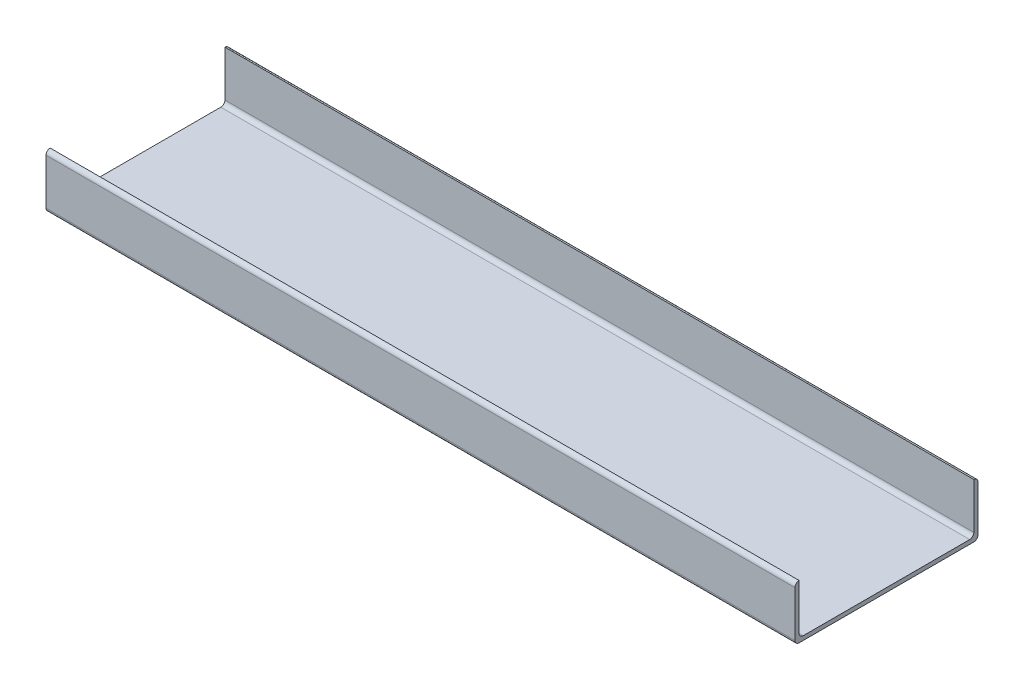
ISO-10303-21;
HEADER;
FILE_DESCRIPTION(('STEP AP214'),'2;1');
FILE_NAME('part.step','',(''),(''),'','','');
FILE_SCHEMA(('AUTOMOTIVE_DESIGN { 1 0 10303 214 1 1 1 1 }'));
ENDSEC;
DATA;
#1=APPLICATION_CONTEXT('core data for automotive mechanical design processes');
#2=APPLICATION_PROTOCOL_DEFINITION('international standard','automotive_design',2000,#1);
#3=PRODUCT_CONTEXT('',#1,'mechanical');
#4=PRODUCT('Part','Part','',(#3));
#5=PRODUCT_RELATED_PRODUCT_CATEGORY('part','',(#4));
#6=PRODUCT_DEFINITION_FORMATION('','',#4);
#7=PRODUCT_DEFINITION_CONTEXT('part definition',#1,'design');
#8=PRODUCT_DEFINITION('design','',#6,#7);
#9=PRODUCT_DEFINITION_SHAPE('','',#8);
#10=(LENGTH_UNIT() NAMED_UNIT(*) SI_UNIT(.MILLI.,.METRE.));
#11=(NAMED_UNIT(*) PLANE_ANGLE_UNIT() SI_UNIT($,.RADIAN.));
#12=(NAMED_UNIT(*) SI_UNIT($,.STERADIAN.) SOLID_ANGLE_UNIT());
#13=UNCERTAINTY_MEASURE_WITH_UNIT(LENGTH_MEASURE(1.E-05),#10,'distance_accuracy_value','');
#14=(GEOMETRIC_REPRESENTATION_CONTEXT(3) GLOBAL_UNCERTAINTY_ASSIGNED_CONTEXT((#13)) GLOBAL_UNIT_ASSIGNED_CONTEXT((#10,
#11,#12)) REPRESENTATION_CONTEXT('',''));
#15=CARTESIAN_POINT('',(0.,0.,0.));
#16=DIRECTION('',(0.,0.,1.));
#17=DIRECTION('',(1.,0.,0.));
#18=AXIS2_PLACEMENT_3D('',#15,#16,#17);
#19=CARTESIAN_POINT('',(-90.,1.,-21.));
#20=DIRECTION('',(-1.,0.,0.));
#21=DIRECTION('',(0.,0.,1.));
#22=AXIS2_PLACEMENT_3D('',#19,#20,#21);
#23=CYLINDRICAL_SURFACE('',#22,1.);
#24=DIRECTION('',(-1.,0.,0.));
#25=VECTOR('',#24,1.);
#26=CARTESIAN_POINT('',(-90.,1.,-22.));
#27=LINE('',#26,#25);
#28=CARTESIAN_POINT('',(90.,1.,-22.));
#29=VERTEX_POINT('',#28);
#30=CARTESIAN_POINT('',(-90.,1.,-22.));
#31=VERTEX_POINT('',#30);
#32=EDGE_CURVE('E191',#29,#31,#27,.T.);
#33=ORIENTED_EDGE('',*,*,#32,.F.);
#34=CARTESIAN_POINT('',(90.,1.,-21.));
#35=DIRECTION('',(-1.,0.,0.));
#36=DIRECTION('',(0.,0.,1.));
#37=AXIS2_PLACEMENT_3D('',#34,#35,#36);
#38=CIRCLE('',#37,1.);
#39=CARTESIAN_POINT('',(90.,0.,-21.));
#40=VERTEX_POINT('',#39);
#41=EDGE_CURVE('E39',#40,#29,#38,.F.);
#42=ORIENTED_EDGE('',*,*,#41,.F.);
#43=DIRECTION('',(-1.,0.,0.));
#44=VECTOR('',#43,1.);
#45=CARTESIAN_POINT('',(0.,0.,-21.));
#46=LINE('',#45,#44);
#47=CARTESIAN_POINT('',(-90.,0.,-21.));
#48=VERTEX_POINT('',#47);
#49=EDGE_CURVE('E194',#48,#40,#46,.F.);
#50=ORIENTED_EDGE('',*,*,#49,.F.);
#51=CARTESIAN_POINT('',(-90.,1.,-21.));
#52=DIRECTION('',(1.,0.,0.));
#53=DIRECTION('',(0.,0.,-1.));
#54=AXIS2_PLACEMENT_3D('',#51,#52,#53);
#55=CIRCLE('',#54,1.);
#56=EDGE_CURVE('E11',#31,#48,#55,.F.);
#57=ORIENTED_EDGE('',*,*,#56,.F.);
#58=EDGE_LOOP('',(#33,#42,#50,#57));
#59=FACE_BOUND('',#58,.T.);
#60=ADVANCED_FACE('F32',(#59),#23,.T.);
#61=CARTESIAN_POINT('',(-90.,1.,21.));
#62=DIRECTION('',(1.,0.,0.));
#63=DIRECTION('',(0.,0.,-1.));
#64=AXIS2_PLACEMENT_3D('',#61,#62,#63);
#65=CYLINDRICAL_SURFACE('',#64,1.);
#66=DIRECTION('',(1.,0.,0.));
#67=VECTOR('',#66,1.);
#68=CARTESIAN_POINT('',(-90.,1.,22.));
#69=LINE('',#68,#67);
#70=CARTESIAN_POINT('',(-90.,1.,22.));
#71=VERTEX_POINT('',#70);
#72=CARTESIAN_POINT('',(90.,1.,22.));
#73=VERTEX_POINT('',#72);
#74=EDGE_CURVE('E181',#71,#73,#69,.T.);
#75=ORIENTED_EDGE('',*,*,#74,.F.);
#76=CARTESIAN_POINT('',(-90.,1.,21.));
#77=DIRECTION('',(1.,0.,0.));
#78=DIRECTION('',(0.,0.,-1.));
#79=AXIS2_PLACEMENT_3D('',#76,#77,#78);
#80=CIRCLE('',#79,1.);
#81=CARTESIAN_POINT('',(-90.,0.,21.));
#82=VERTEX_POINT('',#81);
#83=EDGE_CURVE('E187',#82,#71,#80,.F.);
#84=ORIENTED_EDGE('',*,*,#83,.F.);
#85=DIRECTION('',(1.,0.,0.));
#86=VECTOR('',#85,1.);
#87=CARTESIAN_POINT('',(0.,0.,21.));
#88=LINE('',#87,#86);
#89=CARTESIAN_POINT('',(90.,0.,21.));
#90=VERTEX_POINT('',#89);
#91=EDGE_CURVE('E184',#90,#82,#88,.F.);
#92=ORIENTED_EDGE('',*,*,#91,.F.);
#93=CARTESIAN_POINT('',(90.,1.,21.));
#94=DIRECTION('',(-1.,0.,0.));
#95=DIRECTION('',(0.,0.,1.));
#96=AXIS2_PLACEMENT_3D('',#93,#94,#95);
#97=CIRCLE('',#96,1.);
#98=EDGE_CURVE('E189',#73,#90,#97,.F.);
#99=ORIENTED_EDGE('',*,*,#98,.F.);
#100=EDGE_LOOP('',(#75,#84,#92,#99));
#101=FACE_BOUND('',#100,.T.);
#102=ADVANCED_FACE('F255',(#101),#65,.T.);
#103=CARTESIAN_POINT('',(-90.,2.,20.));
#104=DIRECTION('',(-1.,0.,0.));
#105=DIRECTION('',(0.,0.,1.));
#106=AXIS2_PLACEMENT_3D('',#103,#104,#105);
#107=CYLINDRICAL_SURFACE('',#106,1.);
#108=DIRECTION('',(-1.,0.,0.));
#109=VECTOR('',#108,1.);
#110=CARTESIAN_POINT('',(-90.,2.,21.));
#111=LINE('',#110,#109);
#112=CARTESIAN_POINT('',(90.,2.,21.));
#113=VERTEX_POINT('',#112);
#114=CARTESIAN_POINT('',(-90.,2.,21.));
#115=VERTEX_POINT('',#114);
#116=EDGE_CURVE('E171',#113,#115,#111,.T.);
#117=ORIENTED_EDGE('',*,*,#116,.F.);
#118=CARTESIAN_POINT('',(90.,2.,20.));
#119=DIRECTION('',(-1.,0.,0.));
#120=DIRECTION('',(0.,0.,1.));
#121=AXIS2_PLACEMENT_3D('',#118,#119,#120);
#122=CIRCLE('',#121,1.);
#123=CARTESIAN_POINT('',(90.,1.,20.));
#124=VERTEX_POINT('',#123);
#125=EDGE_CURVE('E136',#113,#124,#122,.F.);
#126=ORIENTED_EDGE('',*,*,#125,.T.);
#127=DIRECTION('',(-1.,0.,0.));
#128=VECTOR('',#127,1.);
#129=CARTESIAN_POINT('',(0.,1.,20.));
#130=LINE('',#129,#128);
#131=CARTESIAN_POINT('',(-90.,1.,20.));
#132=VERTEX_POINT('',#131);
#133=EDGE_CURVE('E173',#132,#124,#130,.F.);
#134=ORIENTED_EDGE('',*,*,#133,.F.);
#135=CARTESIAN_POINT('',(-90.,2.,20.));
#136=DIRECTION('',(1.,0.,0.));
#137=DIRECTION('',(0.,0.,-1.));
#138=AXIS2_PLACEMENT_3D('',#135,#136,#137);
#139=CIRCLE('',#138,1.);
#140=EDGE_CURVE('E179',#132,#115,#139,.F.);
#141=ORIENTED_EDGE('',*,*,#140,.T.);
#142=EDGE_LOOP('',(#117,#126,#134,#141));
#143=FACE_BOUND('',#142,.T.);
#144=ADVANCED_FACE('F247',(#143),#107,.F.);
#145=CARTESIAN_POINT('',(-90.,2.,-20.));
#146=DIRECTION('',(1.,0.,0.));
#147=DIRECTION('',(0.,0.,-1.));
#148=AXIS2_PLACEMENT_3D('',#145,#146,#147);
#149=CYLINDRICAL_SURFACE('',#148,1.);
#150=DIRECTION('',(1.,0.,0.));
#151=VECTOR('',#150,1.);
#152=CARTESIAN_POINT('',(-90.,2.,-21.));
#153=LINE('',#152,#151);
#154=CARTESIAN_POINT('',(-90.,2.,-21.));
#155=VERTEX_POINT('',#154);
#156=CARTESIAN_POINT('',(90.,2.,-21.));
#157=VERTEX_POINT('',#156);
#158=EDGE_CURVE('E162',#155,#157,#153,.T.);
#159=ORIENTED_EDGE('',*,*,#158,.F.);
#160=CARTESIAN_POINT('',(-90.,2.,-20.));
#161=DIRECTION('',(1.,0.,0.));
#162=DIRECTION('',(0.,0.,-1.));
#163=AXIS2_PLACEMENT_3D('',#160,#161,#162);
#164=CIRCLE('',#163,1.);
#165=CARTESIAN_POINT('',(-90.,1.,-20.));
#166=VERTEX_POINT('',#165);
#167=EDGE_CURVE('E167',#155,#166,#164,.F.);
#168=ORIENTED_EDGE('',*,*,#167,.T.);
#169=DIRECTION('',(1.,0.,0.));
#170=VECTOR('',#169,1.);
#171=CARTESIAN_POINT('',(0.,1.,-20.));
#172=LINE('',#171,#170);
#173=CARTESIAN_POINT('',(90.,1.,-20.));
#174=VERTEX_POINT('',#173);
#175=EDGE_CURVE('E164',#174,#166,#172,.F.);
#176=ORIENTED_EDGE('',*,*,#175,.F.);
#177=CARTESIAN_POINT('',(90.,2.,-20.));
#178=DIRECTION('',(-1.,0.,0.));
#179=DIRECTION('',(0.,0.,1.));
#180=AXIS2_PLACEMENT_3D('',#177,#178,#179);
#181=CIRCLE('',#180,1.);
#182=EDGE_CURVE('E169',#174,#157,#181,.F.);
#183=ORIENTED_EDGE('',*,*,#182,.T.);
#184=EDGE_LOOP('',(#159,#168,#176,#183));
#185=FACE_BOUND('',#184,.T.);
#186=ADVANCED_FACE('F242',(#185),#149,.F.);
#187=CARTESIAN_POINT('',(0.,12.,-21.));
#188=DIRECTION('',(1.,0.,0.));
#189=DIRECTION('',(0.,0.,-1.));
#190=AXIS2_PLACEMENT_3D('',#187,#188,#189);
#191=CYLINDRICAL_SURFACE('',#190,1.);
#192=DIRECTION('',(1.,0.,0.));
#193=VECTOR('',#192,1.);
#194=CARTESIAN_POINT('',(-90.,13.,-21.));
#195=LINE('',#194,#193);
#196=CARTESIAN_POINT('',(-90.,13.,-21.));
#197=VERTEX_POINT('',#196);
#198=CARTESIAN_POINT('',(90.,13.,-21.));
#199=VERTEX_POINT('',#198);
#200=EDGE_CURVE('E140',#197,#199,#195,.T.);
#201=ORIENTED_EDGE('',*,*,#200,.T.);
#202=CARTESIAN_POINT('',(90.,12.,-21.));
#203=DIRECTION('',(-1.,0.,0.));
#204=DIRECTION('',(0.,0.,1.));
#205=AXIS2_PLACEMENT_3D('',#202,#203,#204);
#206=CIRCLE('',#205,1.);
#207=CARTESIAN_POINT('',(90.,12.,-22.));
#208=VERTEX_POINT('',#207);
#209=EDGE_CURVE('E226',#208,#199,#206,.F.);
#210=ORIENTED_EDGE('',*,*,#209,.F.);
#211=DIRECTION('',(-1.,0.,0.));
#212=VECTOR('',#211,1.);
#213=CARTESIAN_POINT('',(0.,12.,-22.));
#214=LINE('',#213,#212);
#215=CARTESIAN_POINT('',(-90.,12.,-22.));
#216=VERTEX_POINT('',#215);
#217=EDGE_CURVE('E128',#216,#208,#214,.F.);
#218=ORIENTED_EDGE('',*,*,#217,.F.);
#219=CARTESIAN_POINT('',(-90.,12.,-21.));
#220=DIRECTION('',(1.,0.,0.));
#221=DIRECTION('',(0.,0.,-1.));
#222=AXIS2_PLACEMENT_3D('',#219,#220,#221);
#223=CIRCLE('',#222,1.);
#224=EDGE_CURVE('E227',#197,#216,#223,.F.);
#225=ORIENTED_EDGE('',*,*,#224,.F.);
#226=EDGE_LOOP('',(#201,#210,#218,#225));
#227=FACE_BOUND('',#226,.T.);
#228=ADVANCED_FACE('F239',(#227),#191,.T.);
#229=CARTESIAN_POINT('',(0.,12.,21.));
#230=DIRECTION('',(1.,0.,0.));
#231=DIRECTION('',(0.,0.,-1.));
#232=AXIS2_PLACEMENT_3D('',#229,#230,#231);
#233=CYLINDRICAL_SURFACE('',#232,1.);
#234=DIRECTION('',(-1.,0.,0.));
#235=VECTOR('',#234,1.);
#236=CARTESIAN_POINT('',(-90.,13.,21.));
#237=LINE('',#236,#235);
#238=CARTESIAN_POINT('',(90.,13.,21.));
#239=VERTEX_POINT('',#238);
#240=CARTESIAN_POINT('',(-90.,13.,21.));
#241=VERTEX_POINT('',#240);
#242=EDGE_CURVE('E121',#239,#241,#237,.T.);
#243=ORIENTED_EDGE('',*,*,#242,.T.);
#244=CARTESIAN_POINT('',(-90.,12.,21.));
#245=DIRECTION('',(1.,0.,0.));
#246=DIRECTION('',(0.,0.,-1.));
#247=AXIS2_PLACEMENT_3D('',#244,#245,#246);
#248=CIRCLE('',#247,1.);
#249=CARTESIAN_POINT('',(-90.,12.,22.));
#250=VERTEX_POINT('',#249);
#251=EDGE_CURVE('E129',#250,#241,#248,.F.);
#252=ORIENTED_EDGE('',*,*,#251,.F.);
#253=DIRECTION('',(1.,0.,0.));
#254=VECTOR('',#253,1.);
#255=CARTESIAN_POINT('',(-90.,12.,22.));
#256=LINE('',#255,#254);
#257=CARTESIAN_POINT('',(90.,12.,22.));
#258=VERTEX_POINT('',#257);
#259=EDGE_CURVE('E124',#258,#250,#256,.F.);
#260=ORIENTED_EDGE('',*,*,#259,.F.);
#261=CARTESIAN_POINT('',(90.,12.,21.));
#262=DIRECTION('',(-1.,0.,0.));
#263=DIRECTION('',(0.,0.,1.));
#264=AXIS2_PLACEMENT_3D('',#261,#262,#263);
#265=CIRCLE('',#264,1.);
#266=EDGE_CURVE('E117',#239,#258,#265,.F.);
#267=ORIENTED_EDGE('',*,*,#266,.F.);
#268=EDGE_LOOP('',(#243,#252,#260,#267));
#269=FACE_BOUND('',#268,.T.);
#270=ADVANCED_FACE('F119',(#269),#233,.T.);
#271=CARTESIAN_POINT('',(0.,1.,0.));
#272=DIRECTION('',(0.,1.,0.));
#273=DIRECTION('',(0.,0.,1.));
#274=AXIS2_PLACEMENT_3D('',#271,#272,#273);
#275=PLANE('',#274);
#276=DIRECTION('',(0.,0.,1.));
#277=VECTOR('',#276,1.);
#278=CARTESIAN_POINT('',(-90.,1.,-22.));
#279=LINE('',#278,#277);
#280=EDGE_CURVE('E156',#166,#132,#279,.T.);
#281=ORIENTED_EDGE('',*,*,#280,.T.);
#282=ORIENTED_EDGE('',*,*,#133,.T.);
#283=DIRECTION('',(0.,0.,-1.));
#284=VECTOR('',#283,1.);
#285=CARTESIAN_POINT('',(90.,1.,-22.));
#286=LINE('',#285,#284);
#287=EDGE_CURVE('E160',#124,#174,#286,.T.);
#288=ORIENTED_EDGE('',*,*,#287,.T.);
#289=ORIENTED_EDGE('',*,*,#175,.T.);
#290=EDGE_LOOP('',(#281,#282,#288,#289));
#291=FACE_BOUND('',#290,.T.);
#292=ADVANCED_FACE('F244',(#291),#275,.T.);
#293=CARTESIAN_POINT('',(-90.,1.,-22.));
#294=DIRECTION('',(1.,0.,0.));
#295=DIRECTION('',(0.,0.,-1.));
#296=AXIS2_PLACEMENT_3D('',#293,#294,#295);
#297=PLANE('',#296);
#298=DIRECTION('',(0.,-1.,0.));
#299=VECTOR('',#298,1.);
#300=CARTESIAN_POINT('',(-90.,1.,-22.));
#301=LINE('',#300,#299);
#302=EDGE_CURVE('E175',#216,#31,#301,.T.);
#303=ORIENTED_EDGE('',*,*,#302,.T.);
#304=ORIENTED_EDGE('',*,*,#56,.T.);
#305=DIRECTION('',(0.,0.,1.));
#306=VECTOR('',#305,1.);
#307=CARTESIAN_POINT('',(-90.,0.,-22.));
#308=LINE('',#307,#306);
#309=EDGE_CURVE('E220',#48,#82,#308,.T.);
#310=ORIENTED_EDGE('',*,*,#309,.T.);
#311=ORIENTED_EDGE('',*,*,#83,.T.);
#312=DIRECTION('',(0.,-1.,0.));
#313=VECTOR('',#312,1.);
#314=CARTESIAN_POINT('',(-90.,1.,22.));
#315=LINE('',#314,#313);
#316=EDGE_CURVE('E206',#250,#71,#315,.T.);
#317=ORIENTED_EDGE('',*,*,#316,.F.);
#318=ORIENTED_EDGE('',*,*,#251,.T.);
#319=DIRECTION('',(0.,-1.,0.));
#320=VECTOR('',#319,1.);
#321=CARTESIAN_POINT('',(-90.,13.,21.));
#322=LINE('',#321,#320);
#323=EDGE_CURVE('E141',#241,#115,#322,.T.);
#324=ORIENTED_EDGE('',*,*,#323,.T.);
#325=ORIENTED_EDGE('',*,*,#140,.F.);
#326=ORIENTED_EDGE('',*,*,#280,.F.);
#327=ORIENTED_EDGE('',*,*,#167,.F.);
#328=DIRECTION('',(0.,-1.,0.));
#329=VECTOR('',#328,1.);
#330=CARTESIAN_POINT('',(-90.,13.,-21.));
#331=LINE('',#330,#329);
#332=EDGE_CURVE('E215',#197,#155,#331,.T.);
#333=ORIENTED_EDGE('',*,*,#332,.F.);
#334=ORIENTED_EDGE('',*,*,#224,.T.);
#335=EDGE_LOOP('',(#303,#304,#310,#311,#317,#318,#324,#325,#326,#327,#333,#334));
#336=FACE_BOUND('',#335,.T.);
#337=ADVANCED_FACE('F240',(#336),#297,.F.);
#338=CARTESIAN_POINT('',(-90.,1.,22.));
#339=DIRECTION('',(0.,0.,-1.));
#340=DIRECTION('',(-1.,0.,0.));
#341=AXIS2_PLACEMENT_3D('',#338,#339,#340);
#342=PLANE('',#341);
#343=ORIENTED_EDGE('',*,*,#316,.T.);
#344=ORIENTED_EDGE('',*,*,#74,.T.);
#345=DIRECTION('',(0.,-1.,0.));
#346=VECTOR('',#345,1.);
#347=CARTESIAN_POINT('',(90.,1.,22.));
#348=LINE('',#347,#346);
#349=EDGE_CURVE('E204',#258,#73,#348,.T.);
#350=ORIENTED_EDGE('',*,*,#349,.F.);
#351=ORIENTED_EDGE('',*,*,#259,.T.);
#352=EDGE_LOOP('',(#343,#344,#350,#351));
#353=FACE_BOUND('',#352,.T.);
#354=ADVANCED_FACE('F250',(#353),#342,.F.);
#355=CARTESIAN_POINT('',(90.,1.,-22.));
#356=DIRECTION('',(-1.,0.,0.));
#357=DIRECTION('',(0.,0.,1.));
#358=AXIS2_PLACEMENT_3D('',#355,#356,#357);
#359=PLANE('',#358);
#360=DIRECTION('',(0.,0.,-1.));
#361=VECTOR('',#360,1.);
#362=CARTESIAN_POINT('',(90.,0.,-22.));
#363=LINE('',#362,#361);
#364=EDGE_CURVE('E161',#90,#40,#363,.T.);
#365=ORIENTED_EDGE('',*,*,#364,.T.);
#366=ORIENTED_EDGE('',*,*,#41,.T.);
#367=DIRECTION('',(0.,-1.,0.));
#368=VECTOR('',#367,1.);
#369=CARTESIAN_POINT('',(90.,1.,-22.));
#370=LINE('',#369,#368);
#371=EDGE_CURVE('E197',#208,#29,#370,.T.);
#372=ORIENTED_EDGE('',*,*,#371,.F.);
#373=ORIENTED_EDGE('',*,*,#209,.T.);
#374=DIRECTION('',(0.,-1.,0.));
#375=VECTOR('',#374,1.);
#376=CARTESIAN_POINT('',(90.,13.,-21.));
#377=LINE('',#376,#375);
#378=EDGE_CURVE('E150',#199,#157,#377,.T.);
#379=ORIENTED_EDGE('',*,*,#378,.T.);
#380=ORIENTED_EDGE('',*,*,#182,.F.);
#381=ORIENTED_EDGE('',*,*,#287,.F.);
#382=ORIENTED_EDGE('',*,*,#125,.F.);
#383=DIRECTION('',(0.,-1.,0.));
#384=VECTOR('',#383,1.);
#385=CARTESIAN_POINT('',(90.,13.,21.));
#386=LINE('',#385,#384);
#387=EDGE_CURVE('E132',#239,#113,#386,.T.);
#388=ORIENTED_EDGE('',*,*,#387,.F.);
#389=ORIENTED_EDGE('',*,*,#266,.T.);
#390=ORIENTED_EDGE('',*,*,#349,.T.);
#391=ORIENTED_EDGE('',*,*,#98,.T.);
#392=EDGE_LOOP('',(#365,#366,#372,#373,#379,#380,#381,#382,#388,#389,#390,#391));
#393=FACE_BOUND('',#392,.T.);
#394=ADVANCED_FACE('F134',(#393),#359,.F.);
#395=CARTESIAN_POINT('',(-90.,1.,-22.));
#396=DIRECTION('',(0.,0.,1.));
#397=DIRECTION('',(1.,0.,0.));
#398=AXIS2_PLACEMENT_3D('',#395,#396,#397);
#399=PLANE('',#398);
#400=ORIENTED_EDGE('',*,*,#371,.T.);
#401=ORIENTED_EDGE('',*,*,#32,.T.);
#402=ORIENTED_EDGE('',*,*,#302,.F.);
#403=ORIENTED_EDGE('',*,*,#217,.T.);
#404=EDGE_LOOP('',(#400,#401,#402,#403));
#405=FACE_BOUND('',#404,.T.);
#406=ADVANCED_FACE('F202',(#405),#399,.F.);
#407=CARTESIAN_POINT('',(0.,0.,0.));
#408=DIRECTION('',(0.,1.,0.));
#409=DIRECTION('',(0.,0.,1.));
#410=AXIS2_PLACEMENT_3D('',#407,#408,#409);
#411=PLANE('',#410);
#412=ORIENTED_EDGE('',*,*,#309,.F.);
#413=ORIENTED_EDGE('',*,*,#49,.T.);
#414=ORIENTED_EDGE('',*,*,#364,.F.);
#415=ORIENTED_EDGE('',*,*,#91,.T.);
#416=EDGE_LOOP('',(#412,#413,#414,#415));
#417=FACE_BOUND('',#416,.T.);
#418=ADVANCED_FACE('F258',(#417),#411,.F.);
#419=CARTESIAN_POINT('',(-90.,13.,-21.));
#420=DIRECTION('',(0.,0.,-1.));
#421=DIRECTION('',(-1.,0.,0.));
#422=AXIS2_PLACEMENT_3D('',#419,#420,#421);
#423=PLANE('',#422);
#424=ORIENTED_EDGE('',*,*,#332,.T.);
#425=ORIENTED_EDGE('',*,*,#158,.T.);
#426=ORIENTED_EDGE('',*,*,#378,.F.);
#427=ORIENTED_EDGE('',*,*,#200,.F.);
#428=EDGE_LOOP('',(#424,#425,#426,#427));
#429=FACE_BOUND('',#428,.T.);
#430=ADVANCED_FACE('F233',(#429),#423,.F.);
#431=CARTESIAN_POINT('',(-90.,13.,21.));
#432=DIRECTION('',(0.,0.,1.));
#433=DIRECTION('',(1.,0.,0.));
#434=AXIS2_PLACEMENT_3D('',#431,#432,#433);
#435=PLANE('',#434);
#436=ORIENTED_EDGE('',*,*,#387,.T.);
#437=ORIENTED_EDGE('',*,*,#116,.T.);
#438=ORIENTED_EDGE('',*,*,#323,.F.);
#439=ORIENTED_EDGE('',*,*,#242,.F.);
#440=EDGE_LOOP('',(#436,#437,#438,#439));
#441=FACE_BOUND('',#440,.T.);
#442=ADVANCED_FACE('F143',(#441),#435,.F.);
#443=CLOSED_SHELL('',(#60,#102,#144,#186,#228,#270,#292,#337,#354,#394,#406,#418,#430,#442));
#444=MANIFOLD_SOLID_BREP('B2',#443);
#445=ADVANCED_BREP_SHAPE_REPRESENTATION('',(#18,#444),#14);
#446=SHAPE_DEFINITION_REPRESENTATION(#9,#445);
ENDSEC;
END-ISO-10303-21;
